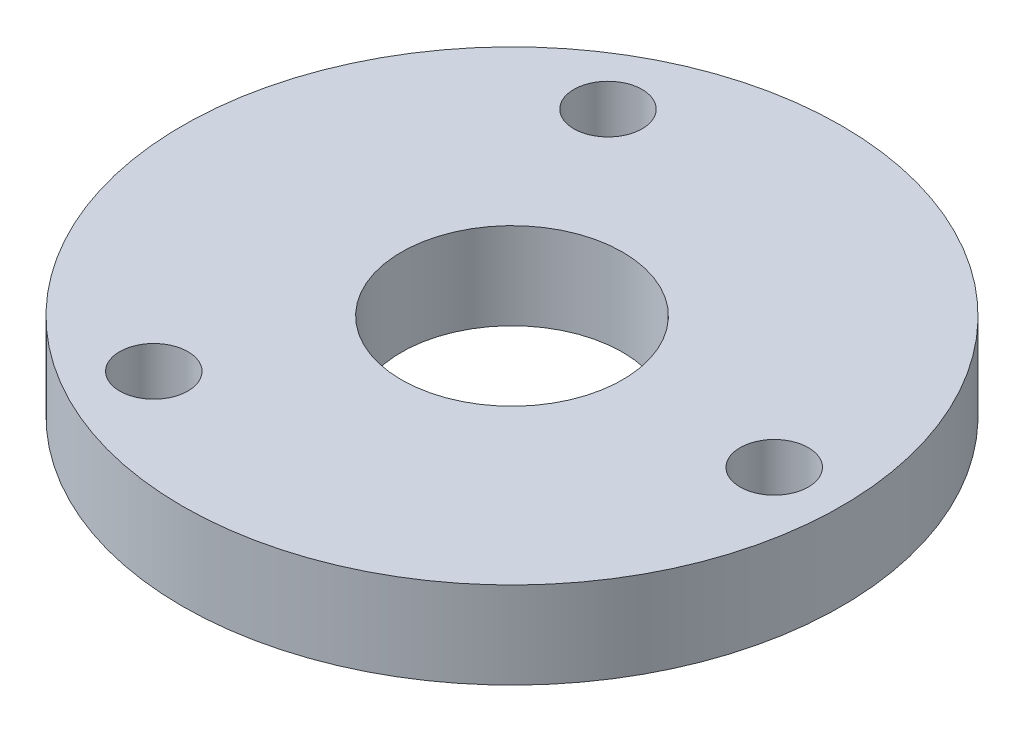
ISO-10303-21;
HEADER;
FILE_DESCRIPTION(('STEP AP214'),'2;1');
FILE_NAME('part.step','',(''),(''),'','','');
FILE_SCHEMA(('AUTOMOTIVE_DESIGN { 1 0 10303 214 1 1 1 1 }'));
ENDSEC;
DATA;
#1=APPLICATION_CONTEXT('core data for automotive mechanical design processes');
#2=APPLICATION_PROTOCOL_DEFINITION('international standard','automotive_design',2000,#1);
#3=PRODUCT_CONTEXT('',#1,'mechanical');
#4=PRODUCT('Part','Part','',(#3));
#5=PRODUCT_RELATED_PRODUCT_CATEGORY('part','',(#4));
#6=PRODUCT_DEFINITION_FORMATION('','',#4);
#7=PRODUCT_DEFINITION_CONTEXT('part definition',#1,'design');
#8=PRODUCT_DEFINITION('design','',#6,#7);
#9=PRODUCT_DEFINITION_SHAPE('','',#8);
#10=(LENGTH_UNIT() NAMED_UNIT(*) SI_UNIT(.MILLI.,.METRE.));
#11=(NAMED_UNIT(*) PLANE_ANGLE_UNIT() SI_UNIT($,.RADIAN.));
#12=(NAMED_UNIT(*) SI_UNIT($,.STERADIAN.) SOLID_ANGLE_UNIT());
#13=UNCERTAINTY_MEASURE_WITH_UNIT(LENGTH_MEASURE(1.E-05),#10,'distance_accuracy_value','');
#14=(GEOMETRIC_REPRESENTATION_CONTEXT(3) GLOBAL_UNCERTAINTY_ASSIGNED_CONTEXT((#13)) GLOBAL_UNIT_ASSIGNED_CONTEXT((#10,
#11,#12)) REPRESENTATION_CONTEXT('',''));
#15=CARTESIAN_POINT('',(0.,0.,0.));
#16=DIRECTION('',(0.,0.,1.));
#17=DIRECTION('',(1.,0.,0.));
#18=AXIS2_PLACEMENT_3D('',#15,#16,#17);
#19=CARTESIAN_POINT('',(0.,6.35,0.));
#20=DIRECTION('',(0.,1.,0.));
#21=DIRECTION('',(0.,0.,1.));
#22=AXIS2_PLACEMENT_3D('',#19,#20,#21);
#23=PLANE('',#22);
#24=CARTESIAN_POINT('',(-9.59999999999985,6.35,16.6276877526613));
#25=DIRECTION('',(0.,1.,0.));
#26=DIRECTION('',(0.,0.,1.));
#27=AXIS2_PLACEMENT_3D('',#24,#25,#26);
#28=CIRCLE('',#27,2.5);
#29=CARTESIAN_POINT('',(-9.59999999999985,6.35,19.1276877526613));
#30=VERTEX_POINT('',#29);
#31=EDGE_CURVE('E60',#30,#30,#28,.T.);
#32=ORIENTED_EDGE('',*,*,#31,.F.);
#33=EDGE_LOOP('',(#32));
#34=FACE_BOUND('',#33,.T.);
#35=CARTESIAN_POINT('',(19.2,6.35,0.));
#36=DIRECTION('',(0.,1.,0.));
#37=DIRECTION('',(0.,0.,1.));
#38=AXIS2_PLACEMENT_3D('',#35,#36,#37);
#39=CIRCLE('',#38,2.5);
#40=CARTESIAN_POINT('',(19.2,6.35,2.5));
#41=VERTEX_POINT('',#40);
#42=EDGE_CURVE('E48',#41,#41,#39,.T.);
#43=ORIENTED_EDGE('',*,*,#42,.F.);
#44=EDGE_LOOP('',(#43));
#45=FACE_BOUND('',#44,.T.);
#46=CARTESIAN_POINT('',(0.,6.35,0.));
#47=DIRECTION('',(0.,1.,0.));
#48=DIRECTION('',(0.,0.,1.));
#49=AXIS2_PLACEMENT_3D('',#46,#47,#48);
#50=CIRCLE('',#49,24.13);
#51=CARTESIAN_POINT('',(0.,6.35,24.13));
#52=VERTEX_POINT('',#51);
#53=EDGE_CURVE('E10',#52,#52,#50,.T.);
#54=ORIENTED_EDGE('',*,*,#53,.T.);
#55=EDGE_LOOP('',(#54));
#56=FACE_BOUND('',#55,.T.);
#57=CARTESIAN_POINT('',(-9.60000000000008,6.35,-16.6276877526612));
#58=DIRECTION('',(0.,1.,0.));
#59=DIRECTION('',(0.,0.,1.));
#60=AXIS2_PLACEMENT_3D('',#57,#58,#59);
#61=CIRCLE('',#60,2.5);
#62=CARTESIAN_POINT('',(-9.60000000000008,6.35,-14.1276877526612));
#63=VERTEX_POINT('',#62);
#64=EDGE_CURVE('E53',#63,#63,#61,.T.);
#65=ORIENTED_EDGE('',*,*,#64,.F.);
#66=EDGE_LOOP('',(#65));
#67=FACE_BOUND('',#66,.T.);
#68=CARTESIAN_POINT('',(0.,6.35,0.));
#69=DIRECTION('',(0.,1.,0.));
#70=DIRECTION('',(0.,0.,1.));
#71=AXIS2_PLACEMENT_3D('',#68,#69,#70);
#72=CIRCLE('',#71,8.1);
#73=CARTESIAN_POINT('',(0.,6.35,8.1));
#74=VERTEX_POINT('',#73);
#75=EDGE_CURVE('E68',#74,#74,#72,.T.);
#76=ORIENTED_EDGE('',*,*,#75,.F.);
#77=EDGE_LOOP('',(#76));
#78=FACE_BOUND('',#77,.T.);
#79=ADVANCED_FACE('F34',(#34,#45,#56,#67,#78),#23,.T.);
#80=CARTESIAN_POINT('',(0.,0.,0.));
#81=DIRECTION('',(0.,1.,0.));
#82=DIRECTION('',(0.,0.,1.));
#83=AXIS2_PLACEMENT_3D('',#80,#81,#82);
#84=PLANE('',#83);
#85=CARTESIAN_POINT('',(0.,0.,0.));
#86=DIRECTION('',(0.,1.,0.));
#87=DIRECTION('',(0.,0.,1.));
#88=AXIS2_PLACEMENT_3D('',#85,#86,#87);
#89=CIRCLE('',#88,24.13);
#90=CARTESIAN_POINT('',(0.,0.,24.13));
#91=VERTEX_POINT('',#90);
#92=EDGE_CURVE('E38',#91,#91,#89,.T.);
#93=ORIENTED_EDGE('',*,*,#92,.F.);
#94=EDGE_LOOP('',(#93));
#95=FACE_BOUND('',#94,.T.);
#96=CARTESIAN_POINT('',(19.2,0.,0.));
#97=DIRECTION('',(0.,1.,0.));
#98=DIRECTION('',(0.,0.,1.));
#99=AXIS2_PLACEMENT_3D('',#96,#97,#98);
#100=CIRCLE('',#99,2.5);
#101=CARTESIAN_POINT('',(19.2,0.,2.5));
#102=VERTEX_POINT('',#101);
#103=EDGE_CURVE('E50',#102,#102,#100,.T.);
#104=ORIENTED_EDGE('',*,*,#103,.T.);
#105=EDGE_LOOP('',(#104));
#106=FACE_BOUND('',#105,.T.);
#107=CARTESIAN_POINT('',(-9.60000000000008,0.,-16.6276877526612));
#108=DIRECTION('',(0.,1.,0.));
#109=DIRECTION('',(0.,0.,1.));
#110=AXIS2_PLACEMENT_3D('',#107,#108,#109);
#111=CIRCLE('',#110,2.5);
#112=CARTESIAN_POINT('',(-9.60000000000008,0.,-14.1276877526612));
#113=VERTEX_POINT('',#112);
#114=EDGE_CURVE('E56',#113,#113,#111,.T.);
#115=ORIENTED_EDGE('',*,*,#114,.T.);
#116=EDGE_LOOP('',(#115));
#117=FACE_BOUND('',#116,.T.);
#118=CARTESIAN_POINT('',(-9.59999999999985,0.,16.6276877526613));
#119=DIRECTION('',(0.,1.,0.));
#120=DIRECTION('',(0.,0.,1.));
#121=AXIS2_PLACEMENT_3D('',#118,#119,#120);
#122=CIRCLE('',#121,2.5);
#123=CARTESIAN_POINT('',(-9.59999999999985,0.,19.1276877526613));
#124=VERTEX_POINT('',#123);
#125=EDGE_CURVE('E64',#124,#124,#122,.T.);
#126=ORIENTED_EDGE('',*,*,#125,.T.);
#127=EDGE_LOOP('',(#126));
#128=FACE_BOUND('',#127,.T.);
#129=CARTESIAN_POINT('',(0.,0.,0.));
#130=DIRECTION('',(0.,1.,0.));
#131=DIRECTION('',(0.,0.,1.));
#132=AXIS2_PLACEMENT_3D('',#129,#130,#131);
#133=CIRCLE('',#132,8.1);
#134=CARTESIAN_POINT('',(0.,0.,8.1));
#135=VERTEX_POINT('',#134);
#136=EDGE_CURVE('E72',#135,#135,#133,.T.);
#137=ORIENTED_EDGE('',*,*,#136,.T.);
#138=EDGE_LOOP('',(#137));
#139=FACE_BOUND('',#138,.T.);
#140=ADVANCED_FACE('F83',(#95,#106,#117,#128,#139),#84,.F.);
#141=CARTESIAN_POINT('',(0.,6.35,0.));
#142=DIRECTION('',(0.,-1.,0.));
#143=DIRECTION('',(0.,0.,-1.));
#144=AXIS2_PLACEMENT_3D('',#141,#142,#143);
#145=CYLINDRICAL_SURFACE('',#144,24.13);
#146=ORIENTED_EDGE('',*,*,#53,.F.);
#147=EDGE_LOOP('',(#146));
#148=FACE_BOUND('',#147,.T.);
#149=ORIENTED_EDGE('',*,*,#92,.T.);
#150=EDGE_LOOP('',(#149));
#151=FACE_BOUND('',#150,.T.);
#152=ADVANCED_FACE('F36',(#148,#151),#145,.T.);
#153=CARTESIAN_POINT('',(19.2,6.35,0.));
#154=DIRECTION('',(0.,-1.,0.));
#155=DIRECTION('',(0.,0.,-1.));
#156=AXIS2_PLACEMENT_3D('',#153,#154,#155);
#157=CYLINDRICAL_SURFACE('',#156,2.5);
#158=ORIENTED_EDGE('',*,*,#42,.T.);
#159=EDGE_LOOP('',(#158));
#160=FACE_BOUND('',#159,.T.);
#161=ORIENTED_EDGE('',*,*,#103,.F.);
#162=EDGE_LOOP('',(#161));
#163=FACE_BOUND('',#162,.T.);
#164=ADVANCED_FACE('F93',(#160,#163),#157,.F.);
#165=CARTESIAN_POINT('',(-9.60000000000008,6.35,-16.6276877526612));
#166=DIRECTION('',(0.,-1.,0.));
#167=DIRECTION('',(0.,0.,-1.));
#168=AXIS2_PLACEMENT_3D('',#165,#166,#167);
#169=CYLINDRICAL_SURFACE('',#168,2.5);
#170=ORIENTED_EDGE('',*,*,#64,.T.);
#171=EDGE_LOOP('',(#170));
#172=FACE_BOUND('',#171,.T.);
#173=ORIENTED_EDGE('',*,*,#114,.F.);
#174=EDGE_LOOP('',(#173));
#175=FACE_BOUND('',#174,.T.);
#176=ADVANCED_FACE('F96',(#172,#175),#169,.F.);
#177=CARTESIAN_POINT('',(-9.59999999999985,6.35,16.6276877526613));
#178=DIRECTION('',(0.,-1.,0.));
#179=DIRECTION('',(0.,0.,-1.));
#180=AXIS2_PLACEMENT_3D('',#177,#178,#179);
#181=CYLINDRICAL_SURFACE('',#180,2.5);
#182=ORIENTED_EDGE('',*,*,#31,.T.);
#183=EDGE_LOOP('',(#182));
#184=FACE_BOUND('',#183,.T.);
#185=ORIENTED_EDGE('',*,*,#125,.F.);
#186=EDGE_LOOP('',(#185));
#187=FACE_BOUND('',#186,.T.);
#188=ADVANCED_FACE('F100',(#184,#187),#181,.F.);
#189=CARTESIAN_POINT('',(0.,6.35,0.));
#190=DIRECTION('',(0.,-1.,0.));
#191=DIRECTION('',(0.,0.,-1.));
#192=AXIS2_PLACEMENT_3D('',#189,#190,#191);
#193=CYLINDRICAL_SURFACE('',#192,8.1);
#194=ORIENTED_EDGE('',*,*,#75,.T.);
#195=EDGE_LOOP('',(#194));
#196=FACE_BOUND('',#195,.T.);
#197=ORIENTED_EDGE('',*,*,#136,.F.);
#198=EDGE_LOOP('',(#197));
#199=FACE_BOUND('',#198,.T.);
#200=ADVANCED_FACE('F79',(#196,#199),#193,.F.);
#201=CLOSED_SHELL('',(#79,#140,#152,#164,#176,#188,#200));
#202=MANIFOLD_SOLID_BREP('B2',#201);
#203=ADVANCED_BREP_SHAPE_REPRESENTATION('',(#18,#202),#14);
#204=SHAPE_DEFINITION_REPRESENTATION(#9,#203);
ENDSEC;
END-ISO-10303-21;
